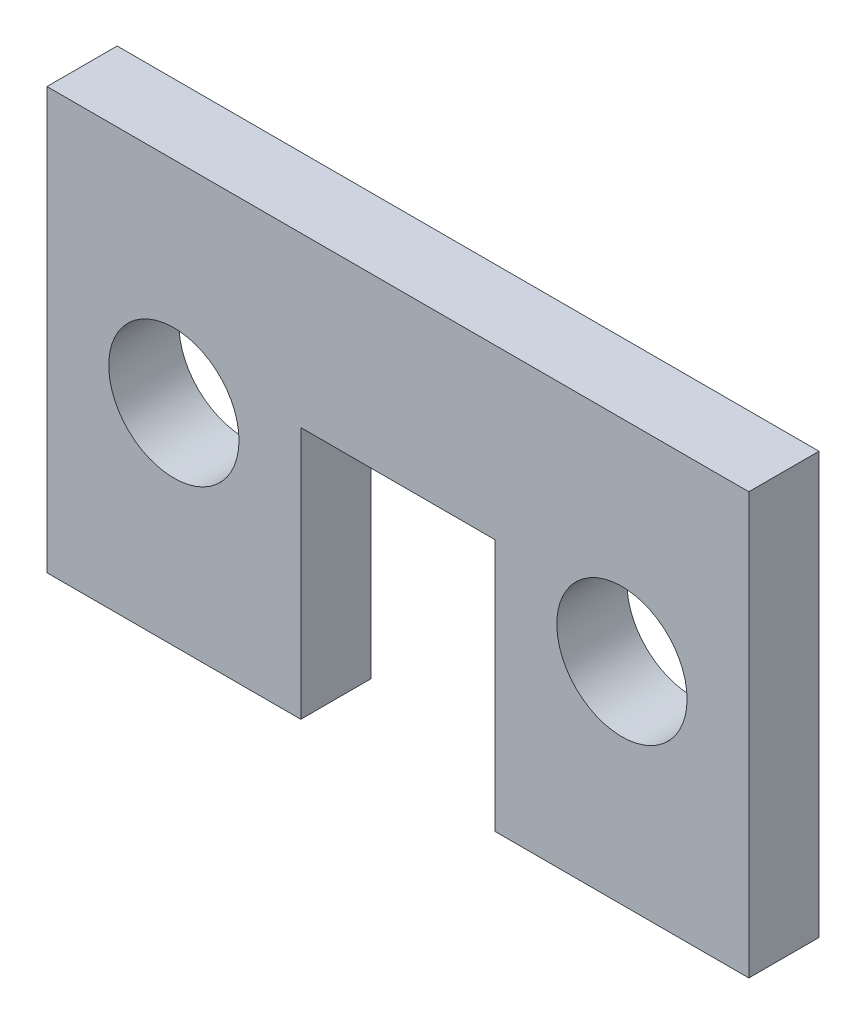
ISO-10303-21;
HEADER;
FILE_DESCRIPTION(('STEP AP214'),'2;1');
FILE_NAME('part.step','',(''),(''),'','','');
FILE_SCHEMA(('AUTOMOTIVE_DESIGN { 1 0 10303 214 1 1 1 1 }'));
ENDSEC;
DATA;
#1=APPLICATION_CONTEXT('core data for automotive mechanical design processes');
#2=APPLICATION_PROTOCOL_DEFINITION('international standard','automotive_design',2000,#1);
#3=PRODUCT_CONTEXT('',#1,'mechanical');
#4=PRODUCT('Part','Part','',(#3));
#5=PRODUCT_RELATED_PRODUCT_CATEGORY('part','',(#4));
#6=PRODUCT_DEFINITION_FORMATION('','',#4);
#7=PRODUCT_DEFINITION_CONTEXT('part definition',#1,'design');
#8=PRODUCT_DEFINITION('design','',#6,#7);
#9=PRODUCT_DEFINITION_SHAPE('','',#8);
#10=(LENGTH_UNIT() NAMED_UNIT(*) SI_UNIT(.MILLI.,.METRE.));
#11=(NAMED_UNIT(*) PLANE_ANGLE_UNIT() SI_UNIT($,.RADIAN.));
#12=(NAMED_UNIT(*) SI_UNIT($,.STERADIAN.) SOLID_ANGLE_UNIT());
#13=UNCERTAINTY_MEASURE_WITH_UNIT(LENGTH_MEASURE(1.E-05),#10,'distance_accuracy_value','');
#14=(GEOMETRIC_REPRESENTATION_CONTEXT(3) GLOBAL_UNCERTAINTY_ASSIGNED_CONTEXT((#13)) GLOBAL_UNIT_ASSIGNED_CONTEXT((#10,
#11,#12)) REPRESENTATION_CONTEXT('',''));
#15=CARTESIAN_POINT('',(0.,0.,0.));
#16=DIRECTION('',(0.,0.,1.));
#17=DIRECTION('',(1.,0.,0.));
#18=AXIS2_PLACEMENT_3D('',#15,#16,#17);
#19=CARTESIAN_POINT('',(-2.19709999999999,2.85749999999999,1.5875));
#20=DIRECTION('',(-1.,0.,0.));
#21=DIRECTION('',(0.,-1.,0.));
#22=AXIS2_PLACEMENT_3D('',#19,#20,#21);
#23=PLANE('',#22);
#24=DIRECTION('',(0.,1.,0.));
#25=VECTOR('',#24,1.);
#26=CARTESIAN_POINT('',(-2.19709999999999,2.85749999999999,0.));
#27=LINE('',#26,#25);
#28=CARTESIAN_POINT('',(-2.19709999999999,-2.85750000000001,0.));
#29=VERTEX_POINT('',#28);
#30=CARTESIAN_POINT('',(-2.19709999999999,2.85749999999999,0.));
#31=VERTEX_POINT('',#30);
#32=EDGE_CURVE('E131',#29,#31,#27,.T.);
#33=ORIENTED_EDGE('',*,*,#32,.T.);
#34=DIRECTION('',(0.,0.,-1.));
#35=VECTOR('',#34,1.);
#36=CARTESIAN_POINT('',(-2.19709999999999,2.85749999999999,1.5875));
#37=LINE('',#36,#35);
#38=CARTESIAN_POINT('',(-2.19709999999999,2.85749999999999,1.5875));
#39=VERTEX_POINT('',#38);
#40=EDGE_CURVE('E11',#39,#31,#37,.T.);
#41=ORIENTED_EDGE('',*,*,#40,.F.);
#42=DIRECTION('',(0.,1.,0.));
#43=VECTOR('',#42,1.);
#44=CARTESIAN_POINT('',(-2.19709999999999,2.85749999999999,1.5875));
#45=LINE('',#44,#43);
#46=CARTESIAN_POINT('',(-2.19709999999999,-2.85750000000001,1.5875));
#47=VERTEX_POINT('',#46);
#48=EDGE_CURVE('E146',#47,#39,#45,.T.);
#49=ORIENTED_EDGE('',*,*,#48,.F.);
#50=DIRECTION('',(0.,0.,-1.));
#51=VECTOR('',#50,1.);
#52=CARTESIAN_POINT('',(-2.19709999999999,-2.85750000000001,1.5875));
#53=LINE('',#52,#51);
#54=EDGE_CURVE('E127',#47,#29,#53,.T.);
#55=ORIENTED_EDGE('',*,*,#54,.T.);
#56=EDGE_LOOP('',(#33,#41,#49,#55));
#57=FACE_BOUND('',#56,.T.);
#58=ADVANCED_FACE('F35',(#57),#23,.F.);
#59=CARTESIAN_POINT('',(-2.19709999999999,2.85749999999999,1.5875));
#60=DIRECTION('',(0.,1.,0.));
#61=DIRECTION('',(0.,0.,1.));
#62=AXIS2_PLACEMENT_3D('',#59,#60,#61);
#63=PLANE('',#62);
#64=DIRECTION('',(1.,0.,0.));
#65=VECTOR('',#64,1.);
#66=CARTESIAN_POINT('',(-2.19709999999999,2.85749999999999,0.));
#67=LINE('',#66,#65);
#68=CARTESIAN_POINT('',(2.19710000000001,2.85749999999999,0.));
#69=VERTEX_POINT('',#68);
#70=EDGE_CURVE('E134',#31,#69,#67,.T.);
#71=ORIENTED_EDGE('',*,*,#70,.T.);
#72=DIRECTION('',(0.,0.,-1.));
#73=VECTOR('',#72,1.);
#74=CARTESIAN_POINT('',(2.19710000000001,2.85749999999999,1.5875));
#75=LINE('',#74,#73);
#76=CARTESIAN_POINT('',(2.19710000000001,2.85749999999999,1.5875));
#77=VERTEX_POINT('',#76);
#78=EDGE_CURVE('E43',#77,#69,#75,.T.);
#79=ORIENTED_EDGE('',*,*,#78,.F.);
#80=DIRECTION('',(1.,0.,0.));
#81=VECTOR('',#80,1.);
#82=CARTESIAN_POINT('',(-2.19709999999999,2.85749999999999,1.5875));
#83=LINE('',#82,#81);
#84=EDGE_CURVE('E94',#39,#77,#83,.T.);
#85=ORIENTED_EDGE('',*,*,#84,.F.);
#86=ORIENTED_EDGE('',*,*,#40,.T.);
#87=EDGE_LOOP('',(#71,#79,#85,#86));
#88=FACE_BOUND('',#87,.T.);
#89=ADVANCED_FACE('F213',(#88),#63,.F.);
#90=CARTESIAN_POINT('',(2.19710000000001,2.85749999999999,1.5875));
#91=DIRECTION('',(1.,0.,0.));
#92=DIRECTION('',(0.,1.,0.));
#93=AXIS2_PLACEMENT_3D('',#90,#91,#92);
#94=PLANE('',#93);
#95=DIRECTION('',(0.,-1.,0.));
#96=VECTOR('',#95,1.);
#97=CARTESIAN_POINT('',(2.19710000000001,2.85749999999999,0.));
#98=LINE('',#97,#96);
#99=CARTESIAN_POINT('',(2.19710000000001,-2.85750000000001,0.));
#100=VERTEX_POINT('',#99);
#101=EDGE_CURVE('E137',#69,#100,#98,.T.);
#102=ORIENTED_EDGE('',*,*,#101,.T.);
#103=DIRECTION('',(0.,0.,-1.));
#104=VECTOR('',#103,1.);
#105=CARTESIAN_POINT('',(2.19710000000001,-2.85750000000001,1.5875));
#106=LINE('',#105,#104);
#107=CARTESIAN_POINT('',(2.19710000000001,-2.85750000000001,1.5875));
#108=VERTEX_POINT('',#107);
#109=EDGE_CURVE('E153',#108,#100,#106,.T.);
#110=ORIENTED_EDGE('',*,*,#109,.F.);
#111=DIRECTION('',(0.,-1.,0.));
#112=VECTOR('',#111,1.);
#113=CARTESIAN_POINT('',(2.19710000000001,2.85749999999999,1.5875));
#114=LINE('',#113,#112);
#115=EDGE_CURVE('E161',#77,#108,#114,.T.);
#116=ORIENTED_EDGE('',*,*,#115,.F.);
#117=ORIENTED_EDGE('',*,*,#78,.T.);
#118=EDGE_LOOP('',(#102,#110,#116,#117));
#119=FACE_BOUND('',#118,.T.);
#120=ADVANCED_FACE('F159',(#119),#94,.F.);
#121=CARTESIAN_POINT('',(2.19710000000001,-2.85750000000001,1.5875));
#122=DIRECTION('',(0.,1.,0.));
#123=DIRECTION('',(-1.,0.,0.));
#124=AXIS2_PLACEMENT_3D('',#121,#122,#123);
#125=PLANE('',#124);
#126=DIRECTION('',(1.,0.,0.));
#127=VECTOR('',#126,1.);
#128=CARTESIAN_POINT('',(2.19710000000001,-2.85750000000001,0.));
#129=LINE('',#128,#127);
#130=CARTESIAN_POINT('',(7.93750000000001,-2.8575,0.));
#131=VERTEX_POINT('',#130);
#132=EDGE_CURVE('E139',#100,#131,#129,.T.);
#133=ORIENTED_EDGE('',*,*,#132,.T.);
#134=DIRECTION('',(0.,0.,-1.));
#135=VECTOR('',#134,1.);
#136=CARTESIAN_POINT('',(7.93750000000001,-2.8575,1.5875));
#137=LINE('',#136,#135);
#138=CARTESIAN_POINT('',(7.93750000000001,-2.8575,1.5875));
#139=VERTEX_POINT('',#138);
#140=EDGE_CURVE('E150',#139,#131,#137,.T.);
#141=ORIENTED_EDGE('',*,*,#140,.F.);
#142=DIRECTION('',(1.,0.,0.));
#143=VECTOR('',#142,1.);
#144=CARTESIAN_POINT('',(2.19710000000001,-2.85750000000001,1.5875));
#145=LINE('',#144,#143);
#146=EDGE_CURVE('E173',#108,#139,#145,.T.);
#147=ORIENTED_EDGE('',*,*,#146,.F.);
#148=ORIENTED_EDGE('',*,*,#109,.T.);
#149=EDGE_LOOP('',(#133,#141,#147,#148));
#150=FACE_BOUND('',#149,.T.);
#151=ADVANCED_FACE('F169',(#150),#125,.F.);
#152=CARTESIAN_POINT('',(7.93750000000001,-2.8575,1.5875));
#153=DIRECTION('',(-1.,0.,0.));
#154=DIRECTION('',(0.,0.,1.));
#155=AXIS2_PLACEMENT_3D('',#152,#153,#154);
#156=PLANE('',#155);
#157=DIRECTION('',(0.,1.,0.));
#158=VECTOR('',#157,1.);
#159=CARTESIAN_POINT('',(7.93750000000001,-2.8575,0.));
#160=LINE('',#159,#158);
#161=CARTESIAN_POINT('',(7.93750000000001,6.66749999999999,0.));
#162=VERTEX_POINT('',#161);
#163=EDGE_CURVE('E141',#131,#162,#160,.T.);
#164=ORIENTED_EDGE('',*,*,#163,.T.);
#165=DIRECTION('',(0.,0.,-1.));
#166=VECTOR('',#165,1.);
#167=CARTESIAN_POINT('',(7.93750000000001,6.66749999999999,1.5875));
#168=LINE('',#167,#166);
#169=CARTESIAN_POINT('',(7.93750000000001,6.66749999999999,1.5875));
#170=VERTEX_POINT('',#169);
#171=EDGE_CURVE('E122',#170,#162,#168,.T.);
#172=ORIENTED_EDGE('',*,*,#171,.F.);
#173=DIRECTION('',(0.,1.,0.));
#174=VECTOR('',#173,1.);
#175=CARTESIAN_POINT('',(7.93750000000001,-2.8575,1.5875));
#176=LINE('',#175,#174);
#177=EDGE_CURVE('E113',#139,#170,#176,.T.);
#178=ORIENTED_EDGE('',*,*,#177,.F.);
#179=ORIENTED_EDGE('',*,*,#140,.T.);
#180=EDGE_LOOP('',(#164,#172,#178,#179));
#181=FACE_BOUND('',#180,.T.);
#182=ADVANCED_FACE('F172',(#181),#156,.F.);
#183=CARTESIAN_POINT('',(-7.93749999999999,6.66749999999999,1.5875));
#184=DIRECTION('',(0.,-1.,0.));
#185=DIRECTION('',(0.,0.,-1.));
#186=AXIS2_PLACEMENT_3D('',#183,#184,#185);
#187=PLANE('',#186);
#188=DIRECTION('',(-1.,0.,0.));
#189=VECTOR('',#188,1.);
#190=CARTESIAN_POINT('',(-7.93749999999999,6.66749999999999,0.));
#191=LINE('',#190,#189);
#192=CARTESIAN_POINT('',(-7.93749999999999,6.66749999999999,0.));
#193=VERTEX_POINT('',#192);
#194=EDGE_CURVE('E121',#162,#193,#191,.T.);
#195=ORIENTED_EDGE('',*,*,#194,.T.);
#196=DIRECTION('',(0.,0.,-1.));
#197=VECTOR('',#196,1.);
#198=CARTESIAN_POINT('',(-7.93749999999999,6.66749999999999,1.5875));
#199=LINE('',#198,#197);
#200=CARTESIAN_POINT('',(-7.93749999999999,6.66749999999999,1.5875));
#201=VERTEX_POINT('',#200);
#202=EDGE_CURVE('E118',#201,#193,#199,.T.);
#203=ORIENTED_EDGE('',*,*,#202,.F.);
#204=DIRECTION('',(-1.,0.,0.));
#205=VECTOR('',#204,1.);
#206=CARTESIAN_POINT('',(-7.93749999999999,6.66749999999999,1.5875));
#207=LINE('',#206,#205);
#208=EDGE_CURVE('E107',#170,#201,#207,.T.);
#209=ORIENTED_EDGE('',*,*,#208,.F.);
#210=ORIENTED_EDGE('',*,*,#171,.T.);
#211=EDGE_LOOP('',(#195,#203,#209,#210));
#212=FACE_BOUND('',#211,.T.);
#213=ADVANCED_FACE('F119',(#212),#187,.F.);
#214=CARTESIAN_POINT('',(-7.93749999999999,-2.8575,1.5875));
#215=DIRECTION('',(1.,0.,0.));
#216=DIRECTION('',(0.,0.,-1.));
#217=AXIS2_PLACEMENT_3D('',#214,#215,#216);
#218=PLANE('',#217);
#219=DIRECTION('',(0.,-1.,0.));
#220=VECTOR('',#219,1.);
#221=CARTESIAN_POINT('',(-7.93749999999999,-2.8575,0.));
#222=LINE('',#221,#220);
#223=CARTESIAN_POINT('',(-7.93749999999999,-2.8575,0.));
#224=VERTEX_POINT('',#223);
#225=EDGE_CURVE('E80',#193,#224,#222,.T.);
#226=ORIENTED_EDGE('',*,*,#225,.T.);
#227=DIRECTION('',(0.,0.,-1.));
#228=VECTOR('',#227,1.);
#229=CARTESIAN_POINT('',(-7.93749999999999,-2.8575,1.5875));
#230=LINE('',#229,#228);
#231=CARTESIAN_POINT('',(-7.93749999999999,-2.8575,1.5875));
#232=VERTEX_POINT('',#231);
#233=EDGE_CURVE('E123',#232,#224,#230,.T.);
#234=ORIENTED_EDGE('',*,*,#233,.F.);
#235=DIRECTION('',(0.,-1.,0.));
#236=VECTOR('',#235,1.);
#237=CARTESIAN_POINT('',(-7.93749999999999,-2.8575,1.5875));
#238=LINE('',#237,#236);
#239=EDGE_CURVE('E111',#201,#232,#238,.T.);
#240=ORIENTED_EDGE('',*,*,#239,.F.);
#241=ORIENTED_EDGE('',*,*,#202,.T.);
#242=EDGE_LOOP('',(#226,#234,#240,#241));
#243=FACE_BOUND('',#242,.T.);
#244=ADVANCED_FACE('F125',(#243),#218,.F.);
#245=CARTESIAN_POINT('',(-2.19709999999999,-2.85750000000001,1.5875));
#246=DIRECTION('',(0.,1.,0.));
#247=DIRECTION('',(-1.,0.,0.));
#248=AXIS2_PLACEMENT_3D('',#245,#246,#247);
#249=PLANE('',#248);
#250=DIRECTION('',(1.,0.,0.));
#251=VECTOR('',#250,1.);
#252=CARTESIAN_POINT('',(-2.19709999999999,-2.85750000000001,0.));
#253=LINE('',#252,#251);
#254=EDGE_CURVE('E86',#224,#29,#253,.T.);
#255=ORIENTED_EDGE('',*,*,#254,.T.);
#256=ORIENTED_EDGE('',*,*,#54,.F.);
#257=DIRECTION('',(1.,0.,0.));
#258=VECTOR('',#257,1.);
#259=CARTESIAN_POINT('',(-2.19709999999999,-2.85750000000001,1.5875));
#260=LINE('',#259,#258);
#261=EDGE_CURVE('E51',#232,#47,#260,.T.);
#262=ORIENTED_EDGE('',*,*,#261,.F.);
#263=ORIENTED_EDGE('',*,*,#233,.T.);
#264=EDGE_LOOP('',(#255,#256,#262,#263));
#265=FACE_BOUND('',#264,.T.);
#266=ADVANCED_FACE('F195',(#265),#249,.F.);
#267=CARTESIAN_POINT('',(-2.19709999999999,-2.85750000000001,1.5875));
#268=DIRECTION('',(0.,0.,-1.));
#269=DIRECTION('',(-1.,0.,0.));
#270=AXIS2_PLACEMENT_3D('',#267,#268,#269);
#271=PLANE('',#270);
#272=CARTESIAN_POINT('',(-5.06729999999999,1.90499999999999,1.5875));
#273=DIRECTION('',(0.,0.,1.));
#274=DIRECTION('',(1.,0.,0.));
#275=AXIS2_PLACEMENT_3D('',#272,#273,#274);
#276=CIRCLE('',#275,1.47319999999999);
#277=CARTESIAN_POINT('',(-3.5941,1.90499999999999,1.5875));
#278=VERTEX_POINT('',#277);
#279=EDGE_CURVE('E187',#278,#278,#276,.T.);
#280=ORIENTED_EDGE('',*,*,#279,.F.);
#281=EDGE_LOOP('',(#280));
#282=FACE_BOUND('',#281,.T.);
#283=CARTESIAN_POINT('',(5.06730000000001,1.90499999999999,1.5875));
#284=DIRECTION('',(0.,0.,1.));
#285=DIRECTION('',(1.,0.,0.));
#286=AXIS2_PLACEMENT_3D('',#283,#284,#285);
#287=CIRCLE('',#286,1.47319999999999);
#288=CARTESIAN_POINT('',(6.5405,1.90499999999999,1.5875));
#289=VERTEX_POINT('',#288);
#290=EDGE_CURVE('E181',#289,#289,#287,.T.);
#291=ORIENTED_EDGE('',*,*,#290,.F.);
#292=EDGE_LOOP('',(#291));
#293=FACE_BOUND('',#292,.T.);
#294=ORIENTED_EDGE('',*,*,#48,.T.);
#295=ORIENTED_EDGE('',*,*,#84,.T.);
#296=ORIENTED_EDGE('',*,*,#115,.T.);
#297=ORIENTED_EDGE('',*,*,#146,.T.);
#298=ORIENTED_EDGE('',*,*,#177,.T.);
#299=ORIENTED_EDGE('',*,*,#208,.T.);
#300=ORIENTED_EDGE('',*,*,#239,.T.);
#301=ORIENTED_EDGE('',*,*,#261,.T.);
#302=EDGE_LOOP('',(#294,#295,#296,#297,#298,#299,#300,#301));
#303=FACE_BOUND('',#302,.T.);
#304=ADVANCED_FACE('F109',(#282,#293,#303),#271,.F.);
#305=CARTESIAN_POINT('',(-2.19709999999999,-2.85750000000001,0.));
#306=DIRECTION('',(0.,0.,-1.));
#307=DIRECTION('',(-1.,0.,0.));
#308=AXIS2_PLACEMENT_3D('',#305,#306,#307);
#309=PLANE('',#308);
#310=CARTESIAN_POINT('',(-5.06729999999999,1.90499999999999,0.));
#311=DIRECTION('',(0.,0.,1.));
#312=DIRECTION('',(1.,0.,0.));
#313=AXIS2_PLACEMENT_3D('',#310,#311,#312);
#314=CIRCLE('',#313,1.4732);
#315=CARTESIAN_POINT('',(-3.59409999999999,1.90499999999999,0.));
#316=VERTEX_POINT('',#315);
#317=EDGE_CURVE('E184',#316,#316,#314,.T.);
#318=ORIENTED_EDGE('',*,*,#317,.T.);
#319=EDGE_LOOP('',(#318));
#320=FACE_BOUND('',#319,.T.);
#321=CARTESIAN_POINT('',(5.06730000000001,1.90499999999999,0.));
#322=DIRECTION('',(0.,0.,1.));
#323=DIRECTION('',(1.,0.,0.));
#324=AXIS2_PLACEMENT_3D('',#321,#322,#323);
#325=CIRCLE('',#324,1.4732);
#326=CARTESIAN_POINT('',(6.54050000000001,1.90499999999999,0.));
#327=VERTEX_POINT('',#326);
#328=EDGE_CURVE('E135',#327,#327,#325,.T.);
#329=ORIENTED_EDGE('',*,*,#328,.T.);
#330=EDGE_LOOP('',(#329));
#331=FACE_BOUND('',#330,.T.);
#332=ORIENTED_EDGE('',*,*,#32,.F.);
#333=ORIENTED_EDGE('',*,*,#254,.F.);
#334=ORIENTED_EDGE('',*,*,#225,.F.);
#335=ORIENTED_EDGE('',*,*,#194,.F.);
#336=ORIENTED_EDGE('',*,*,#163,.F.);
#337=ORIENTED_EDGE('',*,*,#132,.F.);
#338=ORIENTED_EDGE('',*,*,#101,.F.);
#339=ORIENTED_EDGE('',*,*,#70,.F.);
#340=EDGE_LOOP('',(#332,#333,#334,#335,#336,#337,#338,#339));
#341=FACE_BOUND('',#340,.T.);
#342=ADVANCED_FACE('F165',(#320,#331,#341),#309,.T.);
#343=CARTESIAN_POINT('',(5.06730000000001,1.90499999999999,1.5875));
#344=DIRECTION('',(0.,0.,1.));
#345=DIRECTION('',(1.,0.,0.));
#346=AXIS2_PLACEMENT_3D('',#343,#344,#345);
#347=CYLINDRICAL_SURFACE('',#346,1.47319999999999);
#348=ORIENTED_EDGE('',*,*,#328,.F.);
#349=EDGE_LOOP('',(#348));
#350=FACE_BOUND('',#349,.T.);
#351=ORIENTED_EDGE('',*,*,#290,.T.);
#352=EDGE_LOOP('',(#351));
#353=FACE_BOUND('',#352,.T.);
#354=ADVANCED_FACE('F199',(#350,#353),#347,.F.);
#355=CARTESIAN_POINT('',(-5.06729999999999,1.90499999999999,1.5875));
#356=DIRECTION('',(0.,0.,1.));
#357=DIRECTION('',(1.,0.,0.));
#358=AXIS2_PLACEMENT_3D('',#355,#356,#357);
#359=CYLINDRICAL_SURFACE('',#358,1.47319999999999);
#360=ORIENTED_EDGE('',*,*,#317,.F.);
#361=EDGE_LOOP('',(#360));
#362=FACE_BOUND('',#361,.T.);
#363=ORIENTED_EDGE('',*,*,#279,.T.);
#364=EDGE_LOOP('',(#363));
#365=FACE_BOUND('',#364,.T.);
#366=ADVANCED_FACE('F191',(#362,#365),#359,.F.);
#367=CLOSED_SHELL('',(#58,#89,#120,#151,#182,#213,#244,#266,#304,#342,#354,#366));
#368=MANIFOLD_SOLID_BREP('B2',#367);
#369=ADVANCED_BREP_SHAPE_REPRESENTATION('',(#18,#368),#14);
#370=SHAPE_DEFINITION_REPRESENTATION(#9,#369);
ENDSEC;
END-ISO-10303-21;
